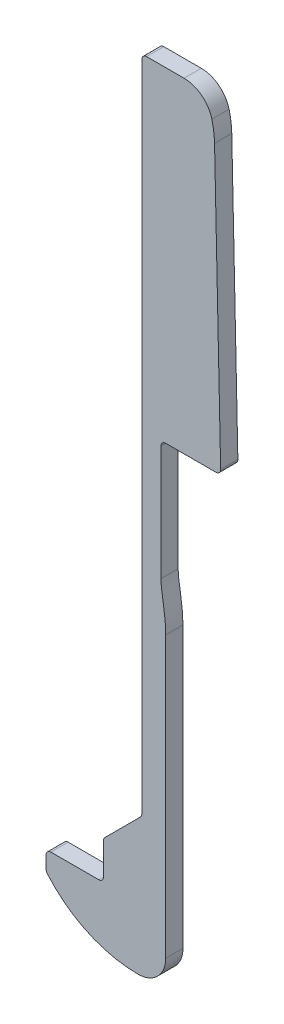
ISO-10303-21;
HEADER;
FILE_DESCRIPTION(('STEP AP214'),'2;1');
FILE_NAME('part.step','',(''),(''),'','','');
FILE_SCHEMA(('AUTOMOTIVE_DESIGN { 1 0 10303 214 1 1 1 1 }'));
ENDSEC;
DATA;
#1=APPLICATION_CONTEXT('core data for automotive mechanical design processes');
#2=APPLICATION_PROTOCOL_DEFINITION('international standard','automotive_design',2000,#1);
#3=PRODUCT_CONTEXT('',#1,'mechanical');
#4=PRODUCT('Part','Part','',(#3));
#5=PRODUCT_RELATED_PRODUCT_CATEGORY('part','',(#4));
#6=PRODUCT_DEFINITION_FORMATION('','',#4);
#7=PRODUCT_DEFINITION_CONTEXT('part definition',#1,'design');
#8=PRODUCT_DEFINITION('design','',#6,#7);
#9=PRODUCT_DEFINITION_SHAPE('','',#8);
#10=(LENGTH_UNIT() NAMED_UNIT(*) SI_UNIT(.MILLI.,.METRE.));
#11=(NAMED_UNIT(*) PLANE_ANGLE_UNIT() SI_UNIT($,.RADIAN.));
#12=(NAMED_UNIT(*) SI_UNIT($,.STERADIAN.) SOLID_ANGLE_UNIT());
#13=UNCERTAINTY_MEASURE_WITH_UNIT(LENGTH_MEASURE(1.E-05),#10,'distance_accuracy_value','');
#14=(GEOMETRIC_REPRESENTATION_CONTEXT(3) GLOBAL_UNCERTAINTY_ASSIGNED_CONTEXT((#13)) GLOBAL_UNIT_ASSIGNED_CONTEXT((#10,
#11,#12)) REPRESENTATION_CONTEXT('',''));
#15=CARTESIAN_POINT('',(0.,0.,0.));
#16=DIRECTION('',(0.,0.,1.));
#17=DIRECTION('',(1.,0.,0.));
#18=AXIS2_PLACEMENT_3D('',#15,#16,#17);
#19=CARTESIAN_POINT('',(14.4143233217841,80.5,1.8));
#20=DIRECTION('',(0.,0.,-1.));
#21=DIRECTION('',(-1.,0.,0.));
#22=AXIS2_PLACEMENT_3D('',#19,#20,#21);
#23=CYLINDRICAL_SURFACE('',#22,3.);
#24=DIRECTION('',(0.,0.,-1.));
#25=VECTOR('',#24,1.);
#26=CARTESIAN_POINT('',(17.3194338133368,81.2485539605604,1.8));
#27=LINE('',#26,#25);
#28=CARTESIAN_POINT('',(17.3194338133368,81.2485539605604,0.));
#29=VERTEX_POINT('',#28);
#30=CARTESIAN_POINT('',(17.3194338133368,81.2485539605604,1.8));
#31=VERTEX_POINT('',#30);
#32=EDGE_CURVE('E291',#29,#31,#27,.F.);
#33=ORIENTED_EDGE('',*,*,#32,.F.);
#34=CARTESIAN_POINT('',(14.4143233217841,80.5,0.));
#35=DIRECTION('',(0.,0.,-1.));
#36=DIRECTION('',(-1.,0.,0.));
#37=AXIS2_PLACEMENT_3D('',#34,#35,#36);
#38=CIRCLE('',#37,3.);
#39=CARTESIAN_POINT('',(14.4143233217841,83.5,0.));
#40=VERTEX_POINT('',#39);
#41=EDGE_CURVE('E45',#40,#29,#38,.T.);
#42=ORIENTED_EDGE('',*,*,#41,.F.);
#43=DIRECTION('',(0.,0.,-1.));
#44=VECTOR('',#43,1.);
#45=CARTESIAN_POINT('',(14.4143233217841,83.5,1.8));
#46=LINE('',#45,#44);
#47=CARTESIAN_POINT('',(14.4143233217841,83.5,1.8));
#48=VERTEX_POINT('',#47);
#49=EDGE_CURVE('E294',#48,#40,#46,.T.);
#50=ORIENTED_EDGE('',*,*,#49,.F.);
#51=CARTESIAN_POINT('',(14.4143233217841,80.5,1.8));
#52=DIRECTION('',(0.,0.,-1.));
#53=DIRECTION('',(-1.,0.,0.));
#54=AXIS2_PLACEMENT_3D('',#51,#52,#53);
#55=CIRCLE('',#54,3.);
#56=EDGE_CURVE('E11',#31,#48,#55,.F.);
#57=ORIENTED_EDGE('',*,*,#56,.F.);
#58=EDGE_LOOP('',(#33,#42,#50,#57));
#59=FACE_BOUND('',#58,.T.);
#60=ADVANCED_FACE('F38',(#59),#23,.T.);
#61=CARTESIAN_POINT('',(9.61,12.5113444444444,1.8));
#62=DIRECTION('',(0.,0.,-1.));
#63=DIRECTION('',(-1.,0.,0.));
#64=AXIS2_PLACEMENT_3D('',#61,#62,#63);
#65=CYLINDRICAL_SURFACE('',#64,12.5113444444444);
#66=CARTESIAN_POINT('',(9.61,12.5113444444444,1.8));
#67=DIRECTION('',(0.,0.,1.));
#68=DIRECTION('',(-1.,0.,0.));
#69=AXIS2_PLACEMENT_3D('',#66,#67,#68);
#70=CIRCLE('',#69,12.5113444444444);
#71=CARTESIAN_POINT('',(0.120775174580328,4.35730544403674,1.8));
#72=VERTEX_POINT('',#71);
#73=CARTESIAN_POINT('',(9.61,0.,1.8));
#74=VERTEX_POINT('',#73);
#75=EDGE_CURVE('E187',#72,#74,#70,.T.);
#76=ORIENTED_EDGE('',*,*,#75,.F.);
#77=DIRECTION('',(0.,0.,-1.));
#78=VECTOR('',#77,1.);
#79=CARTESIAN_POINT('',(0.120775174580328,4.35730544403674,1.8));
#80=LINE('',#79,#78);
#81=CARTESIAN_POINT('',(0.120775174580328,4.35730544403674,0.));
#82=VERTEX_POINT('',#81);
#83=EDGE_CURVE('E247',#72,#82,#80,.T.);
#84=ORIENTED_EDGE('',*,*,#83,.T.);
#85=CARTESIAN_POINT('',(9.61,12.5113444444444,0.));
#86=DIRECTION('',(0.,0.,1.));
#87=DIRECTION('',(-1.,0.,0.));
#88=AXIS2_PLACEMENT_3D('',#85,#86,#87);
#89=CIRCLE('',#88,12.5113444444444);
#90=CARTESIAN_POINT('',(9.61,0.,0.));
#91=VERTEX_POINT('',#90);
#92=EDGE_CURVE('E212',#82,#91,#89,.T.);
#93=ORIENTED_EDGE('',*,*,#92,.T.);
#94=DIRECTION('',(0.,0.,-1.));
#95=VECTOR('',#94,1.);
#96=CARTESIAN_POINT('',(9.61,0.,1.8));
#97=LINE('',#96,#95);
#98=EDGE_CURVE('E204',#74,#91,#97,.T.);
#99=ORIENTED_EDGE('',*,*,#98,.F.);
#100=EDGE_LOOP('',(#76,#84,#93,#99));
#101=FACE_BOUND('',#100,.T.);
#102=ADVANCED_FACE('F210',(#101),#65,.T.);
#103=CARTESIAN_POINT('',(9.61,2.89,1.8));
#104=DIRECTION('',(0.,0.,-1.));
#105=DIRECTION('',(-1.,0.,0.));
#106=AXIS2_PLACEMENT_3D('',#103,#104,#105);
#107=CYLINDRICAL_SURFACE('',#106,2.89000000000001);
#108=CARTESIAN_POINT('',(9.61,2.89,0.));
#109=DIRECTION('',(0.,0.,1.));
#110=DIRECTION('',(-1.,0.,0.));
#111=AXIS2_PLACEMENT_3D('',#108,#109,#110);
#112=CIRCLE('',#111,2.89000000000001);
#113=CARTESIAN_POINT('',(12.5,2.89,0.));
#114=VERTEX_POINT('',#113);
#115=EDGE_CURVE('E351',#91,#114,#112,.T.);
#116=ORIENTED_EDGE('',*,*,#115,.T.);
#117=DIRECTION('',(0.,0.,-1.));
#118=VECTOR('',#117,1.);
#119=CARTESIAN_POINT('',(12.5,2.89,1.8));
#120=LINE('',#119,#118);
#121=CARTESIAN_POINT('',(12.5,2.89,1.8));
#122=VERTEX_POINT('',#121);
#123=EDGE_CURVE('E206',#122,#114,#120,.T.);
#124=ORIENTED_EDGE('',*,*,#123,.F.);
#125=CARTESIAN_POINT('',(9.61,2.89,1.8));
#126=DIRECTION('',(0.,0.,1.));
#127=DIRECTION('',(-1.,0.,0.));
#128=AXIS2_PLACEMENT_3D('',#125,#126,#127);
#129=CIRCLE('',#128,2.89000000000001);
#130=EDGE_CURVE('E190',#74,#122,#129,.T.);
#131=ORIENTED_EDGE('',*,*,#130,.F.);
#132=ORIENTED_EDGE('',*,*,#98,.T.);
#133=EDGE_LOOP('',(#116,#124,#131,#132));
#134=FACE_BOUND('',#133,.T.);
#135=ADVANCED_FACE('F203',(#134),#107,.T.);
#136=CARTESIAN_POINT('',(12.5,32.15,1.8));
#137=DIRECTION('',(-1.,0.,0.));
#138=DIRECTION('',(0.,-1.,0.));
#139=AXIS2_PLACEMENT_3D('',#136,#137,#138);
#140=PLANE('',#139);
#141=DIRECTION('',(0.,1.,0.));
#142=VECTOR('',#141,1.);
#143=CARTESIAN_POINT('',(12.5,32.15,0.));
#144=LINE('',#143,#142);
#145=CARTESIAN_POINT('',(12.5,32.15,0.));
#146=VERTEX_POINT('',#145);
#147=EDGE_CURVE('E346',#114,#146,#144,.T.);
#148=ORIENTED_EDGE('',*,*,#147,.T.);
#149=DIRECTION('',(0.,0.,-1.));
#150=VECTOR('',#149,1.);
#151=CARTESIAN_POINT('',(12.5,32.15,1.8));
#152=LINE('',#151,#150);
#153=CARTESIAN_POINT('',(12.5,32.15,1.8));
#154=VERTEX_POINT('',#153);
#155=EDGE_CURVE('E218',#154,#146,#152,.T.);
#156=ORIENTED_EDGE('',*,*,#155,.F.);
#157=DIRECTION('',(0.,1.,0.));
#158=VECTOR('',#157,1.);
#159=CARTESIAN_POINT('',(12.5,32.15,1.8));
#160=LINE('',#159,#158);
#161=EDGE_CURVE('E208',#122,#154,#160,.T.);
#162=ORIENTED_EDGE('',*,*,#161,.F.);
#163=ORIENTED_EDGE('',*,*,#123,.T.);
#164=EDGE_LOOP('',(#148,#156,#162,#163));
#165=FACE_BOUND('',#164,.T.);
#166=ADVANCED_FACE('F398',(#165),#140,.F.);
#167=CARTESIAN_POINT('',(12.5,32.15,1.8));
#168=CARTESIAN_POINT('',(12.5,34.1534508074309,1.8));
#169=CARTESIAN_POINT('',(12.,35.7421929324208,1.8));
#170=CARTESIAN_POINT('',(12.,37.,1.8));
#171=B_SPLINE_CURVE_WITH_KNOTS('',3,(#167,#168,#169,#170),.UNSPECIFIED.,.F.,.F.,(4,4),(0.,1.),.UNSPECIFIED.);
#172=DIRECTION('',(0.,0.,-1.));
#173=VECTOR('',#172,1.);
#174=SURFACE_OF_LINEAR_EXTRUSION('',#171,#173);
#175=CARTESIAN_POINT('',(12.5,32.15,0.));
#176=CARTESIAN_POINT('',(12.5,34.1534508074309,0.));
#177=CARTESIAN_POINT('',(12.,35.7421929324208,0.));
#178=CARTESIAN_POINT('',(12.,37.,0.));
#179=B_SPLINE_CURVE_WITH_KNOTS('',3,(#175,#176,#177,#178),.UNSPECIFIED.,.F.,.F.,(4,4),(0.,1.),.UNSPECIFIED.);
#180=CARTESIAN_POINT('',(12.,37.,0.));
#181=VERTEX_POINT('',#180);
#182=EDGE_CURVE('E341',#146,#181,#179,.T.);
#183=ORIENTED_EDGE('',*,*,#182,.T.);
#184=DIRECTION('',(0.,0.,-1.));
#185=VECTOR('',#184,1.);
#186=CARTESIAN_POINT('',(12.,37.,1.8));
#187=LINE('',#186,#185);
#188=CARTESIAN_POINT('',(12.,37.,1.8));
#189=VERTEX_POINT('',#188);
#190=EDGE_CURVE('E331',#189,#181,#187,.T.);
#191=ORIENTED_EDGE('',*,*,#190,.F.);
#192=EDGE_CURVE('E342',#154,#189,#171,.T.);
#193=ORIENTED_EDGE('',*,*,#192,.F.);
#194=ORIENTED_EDGE('',*,*,#155,.T.);
#195=EDGE_LOOP('',(#183,#191,#193,#194));
#196=FACE_BOUND('',#195,.T.);
#197=ADVANCED_FACE('F339',(#196),#174,.F.);
#198=CARTESIAN_POINT('',(12.,49.5,1.8));
#199=DIRECTION('',(-1.,0.,0.));
#200=DIRECTION('',(0.,-1.,0.));
#201=AXIS2_PLACEMENT_3D('',#198,#199,#200);
#202=PLANE('',#201);
#203=DIRECTION('',(0.,1.,0.));
#204=VECTOR('',#203,1.);
#205=CARTESIAN_POINT('',(12.,49.5,0.));
#206=LINE('',#205,#204);
#207=CARTESIAN_POINT('',(12.,49.,0.));
#208=VERTEX_POINT('',#207);
#209=EDGE_CURVE('E348',#181,#208,#206,.T.);
#210=ORIENTED_EDGE('',*,*,#209,.T.);
#211=DIRECTION('',(0.,0.,-1.));
#212=VECTOR('',#211,1.);
#213=CARTESIAN_POINT('',(12.,49.,1.8));
#214=LINE('',#213,#212);
#215=CARTESIAN_POINT('',(12.,49.,1.8));
#216=VERTEX_POINT('',#215);
#217=EDGE_CURVE('E274',#208,#216,#214,.F.);
#218=ORIENTED_EDGE('',*,*,#217,.T.);
#219=DIRECTION('',(0.,1.,0.));
#220=VECTOR('',#219,1.);
#221=CARTESIAN_POINT('',(12.,49.5,1.8));
#222=LINE('',#221,#220);
#223=EDGE_CURVE('E380',#189,#216,#222,.T.);
#224=ORIENTED_EDGE('',*,*,#223,.F.);
#225=ORIENTED_EDGE('',*,*,#190,.T.);
#226=EDGE_LOOP('',(#210,#218,#224,#225));
#227=FACE_BOUND('',#226,.T.);
#228=ADVANCED_FACE('F411',(#227),#202,.F.);
#229=CARTESIAN_POINT('',(18.25,49.5,1.8));
#230=DIRECTION('',(0.,1.,0.));
#231=DIRECTION('',(0.,0.,1.));
#232=AXIS2_PLACEMENT_3D('',#229,#230,#231);
#233=PLANE('',#232);
#234=DIRECTION('',(1.,0.,0.));
#235=VECTOR('',#234,1.);
#236=CARTESIAN_POINT('',(18.25,49.5,1.8));
#237=LINE('',#236,#235);
#238=CARTESIAN_POINT('',(12.5,49.5,1.8));
#239=VERTEX_POINT('',#238);
#240=CARTESIAN_POINT('',(17.7389709464066,49.5,1.8));
#241=VERTEX_POINT('',#240);
#242=EDGE_CURVE('E373',#239,#241,#237,.T.);
#243=ORIENTED_EDGE('',*,*,#242,.F.);
#244=DIRECTION('',(0.,0.,-1.));
#245=VECTOR('',#244,1.);
#246=CARTESIAN_POINT('',(12.5,49.5,0.));
#247=LINE('',#246,#245);
#248=CARTESIAN_POINT('',(12.5,49.5,0.));
#249=VERTEX_POINT('',#248);
#250=EDGE_CURVE('E271',#239,#249,#247,.T.);
#251=ORIENTED_EDGE('',*,*,#250,.T.);
#252=DIRECTION('',(1.,0.,0.));
#253=VECTOR('',#252,1.);
#254=CARTESIAN_POINT('',(18.25,49.5,0.));
#255=LINE('',#254,#253);
#256=CARTESIAN_POINT('',(17.7389709464066,49.5,0.));
#257=VERTEX_POINT('',#256);
#258=EDGE_CURVE('E313',#249,#257,#255,.T.);
#259=ORIENTED_EDGE('',*,*,#258,.T.);
#260=DIRECTION('',(0.,0.,-1.));
#261=VECTOR('',#260,1.);
#262=CARTESIAN_POINT('',(17.7389709464066,49.5,1.8));
#263=LINE('',#262,#261);
#264=EDGE_CURVE('E269',#257,#241,#263,.F.);
#265=ORIENTED_EDGE('',*,*,#264,.T.);
#266=EDGE_LOOP('',(#243,#251,#259,#265));
#267=FACE_BOUND('',#266,.T.);
#268=ADVANCED_FACE('F364',(#267),#233,.F.);
#269=CARTESIAN_POINT('',(18.25,49.5,1.8));
#270=DIRECTION('',(-0.999762027079909,-0.0218148850345616,0.));
#271=DIRECTION('',(0.0218148850345616,-0.999762027079909,0.));
#272=AXIS2_PLACEMENT_3D('',#269,#270,#271);
#273=PLANE('',#272);
#274=DIRECTION('',(-0.0218148850345616,0.999762027079909,0.));
#275=VECTOR('',#274,1.);
#276=CARTESIAN_POINT('',(18.25,49.5,1.8));
#277=LINE('',#276,#275);
#278=CARTESIAN_POINT('',(18.2388519599465,50.0109074425173,1.8));
#279=VERTEX_POINT('',#278);
#280=CARTESIAN_POINT('',(17.601960582398,79.1992260441903,1.8));
#281=VERTEX_POINT('',#280);
#282=EDGE_CURVE('E372',#279,#281,#277,.T.);
#283=ORIENTED_EDGE('',*,*,#282,.F.);
#284=DIRECTION('',(0.,0.,-1.));
#285=VECTOR('',#284,1.);
#286=CARTESIAN_POINT('',(18.2388519599465,50.0109074425173,1.8));
#287=LINE('',#286,#285);
#288=CARTESIAN_POINT('',(18.2388519599465,50.0109074425173,0.));
#289=VERTEX_POINT('',#288);
#290=EDGE_CURVE('E276',#279,#289,#287,.T.);
#291=ORIENTED_EDGE('',*,*,#290,.T.);
#292=DIRECTION('',(-0.0218148850345616,0.999762027079909,0.));
#293=VECTOR('',#292,1.);
#294=CARTESIAN_POINT('',(18.25,49.5,0.));
#295=LINE('',#294,#293);
#296=CARTESIAN_POINT('',(17.601960582398,79.1992260441903,0.));
#297=VERTEX_POINT('',#296);
#298=EDGE_CURVE('E309',#289,#297,#295,.T.);
#299=ORIENTED_EDGE('',*,*,#298,.T.);
#300=DIRECTION('',(0.,0.,-1.));
#301=VECTOR('',#300,1.);
#302=CARTESIAN_POINT('',(17.601960582398,79.1992260441903,1.8));
#303=LINE('',#302,#301);
#304=EDGE_CURVE('E308',#281,#297,#303,.T.);
#305=ORIENTED_EDGE('',*,*,#304,.F.);
#306=EDGE_LOOP('',(#283,#291,#299,#305));
#307=FACE_BOUND('',#306,.T.);
#308=ADVANCED_FACE('F375',(#307),#273,.F.);
#309=CARTESIAN_POINT('',(8.60410233867879,79.0028920788793,1.8));
#310=DIRECTION('',(0.,0.,-1.));
#311=DIRECTION('',(-1.,0.,0.));
#312=AXIS2_PLACEMENT_3D('',#309,#310,#311);
#313=CYLINDRICAL_SURFACE('',#312,9.00000000000001);
#314=CARTESIAN_POINT('',(8.60410233867879,79.0028920788793,0.));
#315=DIRECTION('',(0.,0.,1.));
#316=DIRECTION('',(1.,0.,0.));
#317=AXIS2_PLACEMENT_3D('',#314,#315,#316);
#318=CIRCLE('',#317,9.00000000000001);
#319=EDGE_CURVE('E301',#297,#29,#318,.T.);
#320=ORIENTED_EDGE('',*,*,#319,.T.);
#321=ORIENTED_EDGE('',*,*,#32,.T.);
#322=CARTESIAN_POINT('',(8.60410233867879,79.0028920788793,1.8));
#323=DIRECTION('',(0.,0.,1.));
#324=DIRECTION('',(1.,0.,0.));
#325=AXIS2_PLACEMENT_3D('',#322,#323,#324);
#326=CIRCLE('',#325,9.00000000000001);
#327=EDGE_CURVE('E376',#281,#31,#326,.T.);
#328=ORIENTED_EDGE('',*,*,#327,.F.);
#329=ORIENTED_EDGE('',*,*,#304,.T.);
#330=EDGE_LOOP('',(#320,#321,#328,#329));
#331=FACE_BOUND('',#330,.T.);
#332=ADVANCED_FACE('F306',(#331),#313,.T.);
#333=CARTESIAN_POINT('',(10.,83.5,1.8));
#334=DIRECTION('',(0.,-1.,0.));
#335=DIRECTION('',(0.,0.,-1.));
#336=AXIS2_PLACEMENT_3D('',#333,#334,#335);
#337=PLANE('',#336);
#338=DIRECTION('',(-1.,0.,0.));
#339=VECTOR('',#338,1.);
#340=CARTESIAN_POINT('',(10.,83.5,1.8));
#341=LINE('',#340,#339);
#342=CARTESIAN_POINT('',(10.5,83.5,1.8));
#343=VERTEX_POINT('',#342);
#344=EDGE_CURVE('E378',#48,#343,#341,.T.);
#345=ORIENTED_EDGE('',*,*,#344,.F.);
#346=ORIENTED_EDGE('',*,*,#49,.T.);
#347=DIRECTION('',(-1.,0.,0.));
#348=VECTOR('',#347,1.);
#349=CARTESIAN_POINT('',(10.,83.5,0.));
#350=LINE('',#349,#348);
#351=CARTESIAN_POINT('',(10.5,83.5,0.));
#352=VERTEX_POINT('',#351);
#353=EDGE_CURVE('E302',#40,#352,#350,.T.);
#354=ORIENTED_EDGE('',*,*,#353,.T.);
#355=DIRECTION('',(0.,0.,-1.));
#356=VECTOR('',#355,1.);
#357=CARTESIAN_POINT('',(10.5,83.5,1.8));
#358=LINE('',#357,#356);
#359=EDGE_CURVE('E235',#352,#343,#358,.F.);
#360=ORIENTED_EDGE('',*,*,#359,.T.);
#361=EDGE_LOOP('',(#345,#346,#354,#360));
#362=FACE_BOUND('',#361,.T.);
#363=ADVANCED_FACE('F493',(#362),#337,.F.);
#364=CARTESIAN_POINT('',(10.,14.5,1.8));
#365=DIRECTION('',(1.,0.,0.));
#366=DIRECTION('',(0.,0.,-1.));
#367=AXIS2_PLACEMENT_3D('',#364,#365,#366);
#368=PLANE('',#367);
#369=DIRECTION('',(0.,-1.,0.));
#370=VECTOR('',#369,1.);
#371=CARTESIAN_POINT('',(10.,14.5,1.8));
#372=LINE('',#371,#370);
#373=CARTESIAN_POINT('',(10.,83.,1.8));
#374=VERTEX_POINT('',#373);
#375=CARTESIAN_POINT('',(10.,14.7071067811865,1.8));
#376=VERTEX_POINT('',#375);
#377=EDGE_CURVE('E385',#374,#376,#372,.T.);
#378=ORIENTED_EDGE('',*,*,#377,.F.);
#379=DIRECTION('',(0.,0.,-1.));
#380=VECTOR('',#379,1.);
#381=CARTESIAN_POINT('',(10.,83.,1.8));
#382=LINE('',#381,#380);
#383=CARTESIAN_POINT('',(10.,83.,0.));
#384=VERTEX_POINT('',#383);
#385=EDGE_CURVE('E216',#374,#384,#382,.T.);
#386=ORIENTED_EDGE('',*,*,#385,.T.);
#387=DIRECTION('',(0.,-1.,0.));
#388=VECTOR('',#387,1.);
#389=CARTESIAN_POINT('',(10.,14.5,0.));
#390=LINE('',#389,#388);
#391=CARTESIAN_POINT('',(10.,14.7071067811865,0.));
#392=VERTEX_POINT('',#391);
#393=EDGE_CURVE('E311',#384,#392,#390,.T.);
#394=ORIENTED_EDGE('',*,*,#393,.T.);
#395=DIRECTION('',(0.,0.,-1.));
#396=VECTOR('',#395,1.);
#397=CARTESIAN_POINT('',(10.,14.7071067811865,1.8));
#398=LINE('',#397,#396);
#399=EDGE_CURVE('E214',#392,#376,#398,.F.);
#400=ORIENTED_EDGE('',*,*,#399,.T.);
#401=EDGE_LOOP('',(#378,#386,#394,#400));
#402=FACE_BOUND('',#401,.T.);
#403=ADVANCED_FACE('F500',(#402),#368,.F.);
#404=CARTESIAN_POINT('',(6.,10.5,1.8));
#405=DIRECTION('',(0.707106781186546,-0.707106781186549,0.));
#406=DIRECTION('',(0.707106781186549,0.707106781186546,0.));
#407=AXIS2_PLACEMENT_3D('',#404,#405,#406);
#408=PLANE('',#407);
#409=DIRECTION('',(-0.707106781186549,-0.707106781186546,0.));
#410=VECTOR('',#409,1.);
#411=CARTESIAN_POINT('',(6.,10.5,1.8));
#412=LINE('',#411,#410);
#413=CARTESIAN_POINT('',(9.85355339059327,14.3535533905933,1.8));
#414=VERTEX_POINT('',#413);
#415=CARTESIAN_POINT('',(6.14644660940673,10.6464466094067,1.8));
#416=VERTEX_POINT('',#415);
#417=EDGE_CURVE('E388',#414,#416,#412,.T.);
#418=ORIENTED_EDGE('',*,*,#417,.F.);
#419=DIRECTION('',(0.,0.,-1.));
#420=VECTOR('',#419,1.);
#421=CARTESIAN_POINT('',(9.85355339059327,14.3535533905933,0.));
#422=LINE('',#421,#420);
#423=CARTESIAN_POINT('',(9.85355339059327,14.3535533905933,0.));
#424=VERTEX_POINT('',#423);
#425=EDGE_CURVE('E266',#414,#424,#422,.T.);
#426=ORIENTED_EDGE('',*,*,#425,.T.);
#427=DIRECTION('',(-0.707106781186549,-0.707106781186546,0.));
#428=VECTOR('',#427,1.);
#429=CARTESIAN_POINT('',(6.,10.5,0.));
#430=LINE('',#429,#428);
#431=CARTESIAN_POINT('',(6.14644660940673,10.6464466094067,0.));
#432=VERTEX_POINT('',#431);
#433=EDGE_CURVE('E319',#424,#432,#430,.T.);
#434=ORIENTED_EDGE('',*,*,#433,.T.);
#435=DIRECTION('',(0.,0.,-1.));
#436=VECTOR('',#435,1.);
#437=CARTESIAN_POINT('',(6.14644660940673,10.6464466094067,1.8));
#438=LINE('',#437,#436);
#439=EDGE_CURVE('E264',#432,#416,#438,.F.);
#440=ORIENTED_EDGE('',*,*,#439,.T.);
#441=EDGE_LOOP('',(#418,#426,#434,#440));
#442=FACE_BOUND('',#441,.T.);
#443=ADVANCED_FACE('F508',(#442),#408,.F.);
#444=CARTESIAN_POINT('',(6.,6.5,1.8));
#445=DIRECTION('',(1.,0.,0.));
#446=DIRECTION('',(0.,0.,-1.));
#447=AXIS2_PLACEMENT_3D('',#444,#445,#446);
#448=PLANE('',#447);
#449=DIRECTION('',(0.,-1.,0.));
#450=VECTOR('',#449,1.);
#451=CARTESIAN_POINT('',(6.,6.5,0.));
#452=LINE('',#451,#450);
#453=CARTESIAN_POINT('',(6.,10.2928932188135,0.));
#454=VERTEX_POINT('',#453);
#455=CARTESIAN_POINT('',(6.,7.,0.));
#456=VERTEX_POINT('',#455);
#457=EDGE_CURVE('E322',#454,#456,#452,.T.);
#458=ORIENTED_EDGE('',*,*,#457,.T.);
#459=DIRECTION('',(0.,0.,-1.));
#460=VECTOR('',#459,1.);
#461=CARTESIAN_POINT('',(6.,7.,1.8));
#462=LINE('',#461,#460);
#463=CARTESIAN_POINT('',(6.,7.,1.8));
#464=VERTEX_POINT('',#463);
#465=EDGE_CURVE('E262',#456,#464,#462,.F.);
#466=ORIENTED_EDGE('',*,*,#465,.T.);
#467=DIRECTION('',(0.,-1.,0.));
#468=VECTOR('',#467,1.);
#469=CARTESIAN_POINT('',(6.,6.5,1.8));
#470=LINE('',#469,#468);
#471=CARTESIAN_POINT('',(6.,10.2928932188135,1.8));
#472=VERTEX_POINT('',#471);
#473=EDGE_CURVE('E391',#472,#464,#470,.T.);
#474=ORIENTED_EDGE('',*,*,#473,.F.);
#475=DIRECTION('',(0.,0.,-1.));
#476=VECTOR('',#475,1.);
#477=CARTESIAN_POINT('',(6.,10.2928932188135,1.8));
#478=LINE('',#477,#476);
#479=EDGE_CURVE('E259',#472,#454,#478,.T.);
#480=ORIENTED_EDGE('',*,*,#479,.T.);
#481=EDGE_LOOP('',(#458,#466,#474,#480));
#482=FACE_BOUND('',#481,.T.);
#483=ADVANCED_FACE('F516',(#482),#448,.F.);
#484=CARTESIAN_POINT('',(0.,6.5,1.8));
#485=DIRECTION('',(0.,-1.,0.));
#486=DIRECTION('',(0.,0.,-1.));
#487=AXIS2_PLACEMENT_3D('',#484,#485,#486);
#488=PLANE('',#487);
#489=DIRECTION('',(-1.,0.,0.));
#490=VECTOR('',#489,1.);
#491=CARTESIAN_POINT('',(0.,6.5,0.));
#492=LINE('',#491,#490);
#493=CARTESIAN_POINT('',(5.5,6.5,0.));
#494=VERTEX_POINT('',#493);
#495=CARTESIAN_POINT('',(0.5,6.5,0.));
#496=VERTEX_POINT('',#495);
#497=EDGE_CURVE('E325',#494,#496,#492,.T.);
#498=ORIENTED_EDGE('',*,*,#497,.T.);
#499=DIRECTION('',(0.,0.,-1.));
#500=VECTOR('',#499,1.);
#501=CARTESIAN_POINT('',(0.5,6.5,1.8));
#502=LINE('',#501,#500);
#503=CARTESIAN_POINT('',(0.5,6.5,1.8));
#504=VERTEX_POINT('',#503);
#505=EDGE_CURVE('E257',#496,#504,#502,.F.);
#506=ORIENTED_EDGE('',*,*,#505,.T.);
#507=DIRECTION('',(-1.,0.,0.));
#508=VECTOR('',#507,1.);
#509=CARTESIAN_POINT('',(0.,6.5,1.8));
#510=LINE('',#509,#508);
#511=CARTESIAN_POINT('',(5.5,6.5,1.8));
#512=VERTEX_POINT('',#511);
#513=EDGE_CURVE('E394',#512,#504,#510,.T.);
#514=ORIENTED_EDGE('',*,*,#513,.F.);
#515=DIRECTION('',(0.,0.,-1.));
#516=VECTOR('',#515,1.);
#517=CARTESIAN_POINT('',(5.5,6.5,0.));
#518=LINE('',#517,#516);
#519=EDGE_CURVE('E254',#512,#494,#518,.T.);
#520=ORIENTED_EDGE('',*,*,#519,.T.);
#521=EDGE_LOOP('',(#498,#506,#514,#520));
#522=FACE_BOUND('',#521,.T.);
#523=ADVANCED_FACE('F524',(#522),#488,.F.);
#524=CARTESIAN_POINT('',(0.,4.5,1.8));
#525=DIRECTION('',(1.,0.,0.));
#526=DIRECTION('',(0.,0.,-1.));
#527=AXIS2_PLACEMENT_3D('',#524,#525,#526);
#528=PLANE('',#527);
#529=DIRECTION('',(0.,-1.,0.));
#530=VECTOR('',#529,1.);
#531=CARTESIAN_POINT('',(0.,4.5,0.));
#532=LINE('',#531,#530);
#533=CARTESIAN_POINT('',(0.,6.,0.));
#534=VERTEX_POINT('',#533);
#535=CARTESIAN_POINT('',(0.,4.68317126271894,0.));
#536=VERTEX_POINT('',#535);
#537=EDGE_CURVE('E199',#534,#536,#532,.T.);
#538=ORIENTED_EDGE('',*,*,#537,.T.);
#539=DIRECTION('',(0.,0.,-1.));
#540=VECTOR('',#539,1.);
#541=CARTESIAN_POINT('',(0.,4.68317126271894,1.8));
#542=LINE('',#541,#540);
#543=CARTESIAN_POINT('',(0.,4.68317126271894,1.8));
#544=VERTEX_POINT('',#543);
#545=EDGE_CURVE('E252',#536,#544,#542,.F.);
#546=ORIENTED_EDGE('',*,*,#545,.T.);
#547=DIRECTION('',(0.,-1.,0.));
#548=VECTOR('',#547,1.);
#549=CARTESIAN_POINT('',(0.,4.5,1.8));
#550=LINE('',#549,#548);
#551=CARTESIAN_POINT('',(0.,6.,1.8));
#552=VERTEX_POINT('',#551);
#553=EDGE_CURVE('E332',#552,#544,#550,.T.);
#554=ORIENTED_EDGE('',*,*,#553,.F.);
#555=DIRECTION('',(0.,0.,-1.));
#556=VECTOR('',#555,1.);
#557=CARTESIAN_POINT('',(0.,6.,1.8));
#558=LINE('',#557,#556);
#559=EDGE_CURVE('E249',#552,#534,#558,.T.);
#560=ORIENTED_EDGE('',*,*,#559,.T.);
#561=EDGE_LOOP('',(#538,#546,#554,#560));
#562=FACE_BOUND('',#561,.T.);
#563=ADVANCED_FACE('F532',(#562),#528,.F.);
#564=CARTESIAN_POINT('',(9.61,12.5113444444444,1.8));
#565=DIRECTION('',(0.,0.,-1.));
#566=DIRECTION('',(-1.,0.,0.));
#567=AXIS2_PLACEMENT_3D('',#564,#565,#566);
#568=PLANE('',#567);
#569=ORIENTED_EDGE('',*,*,#327,.T.);
#570=ORIENTED_EDGE('',*,*,#56,.T.);
#571=ORIENTED_EDGE('',*,*,#344,.T.);
#572=CARTESIAN_POINT('',(10.5,83.,1.8));
#573=DIRECTION('',(0.,0.,-1.));
#574=DIRECTION('',(-1.,0.,0.));
#575=AXIS2_PLACEMENT_3D('',#572,#573,#574);
#576=CIRCLE('',#575,0.5);
#577=EDGE_CURVE('E245',#343,#374,#576,.F.);
#578=ORIENTED_EDGE('',*,*,#577,.T.);
#579=ORIENTED_EDGE('',*,*,#377,.T.);
#580=CARTESIAN_POINT('',(9.5,14.7071067811865,1.8));
#581=DIRECTION('',(0.,0.,-1.));
#582=DIRECTION('',(-1.,0.,0.));
#583=AXIS2_PLACEMENT_3D('',#580,#581,#582);
#584=CIRCLE('',#583,0.5);
#585=EDGE_CURVE('E285',#376,#414,#584,.T.);
#586=ORIENTED_EDGE('',*,*,#585,.T.);
#587=ORIENTED_EDGE('',*,*,#417,.T.);
#588=CARTESIAN_POINT('',(6.5,10.2928932188135,1.8));
#589=DIRECTION('',(0.,0.,-1.));
#590=DIRECTION('',(-1.,0.,0.));
#591=AXIS2_PLACEMENT_3D('',#588,#589,#590);
#592=CIRCLE('',#591,0.5);
#593=EDGE_CURVE('E240',#416,#472,#592,.F.);
#594=ORIENTED_EDGE('',*,*,#593,.T.);
#595=ORIENTED_EDGE('',*,*,#473,.T.);
#596=CARTESIAN_POINT('',(5.5,7.,1.8));
#597=DIRECTION('',(0.,0.,-1.));
#598=DIRECTION('',(-1.,0.,0.));
#599=AXIS2_PLACEMENT_3D('',#596,#597,#598);
#600=CIRCLE('',#599,0.5);
#601=EDGE_CURVE('E281',#464,#512,#600,.T.);
#602=ORIENTED_EDGE('',*,*,#601,.T.);
#603=ORIENTED_EDGE('',*,*,#513,.T.);
#604=CARTESIAN_POINT('',(0.5,6.,1.8));
#605=DIRECTION('',(0.,0.,-1.));
#606=DIRECTION('',(-1.,0.,0.));
#607=AXIS2_PLACEMENT_3D('',#604,#605,#606);
#608=CIRCLE('',#607,0.5);
#609=EDGE_CURVE('E242',#504,#552,#608,.F.);
#610=ORIENTED_EDGE('',*,*,#609,.T.);
#611=ORIENTED_EDGE('',*,*,#553,.T.);
#612=CARTESIAN_POINT('',(0.5,4.68317126271894,1.8));
#613=DIRECTION('',(0.,0.,-1.));
#614=DIRECTION('',(-1.,0.,0.));
#615=AXIS2_PLACEMENT_3D('',#612,#613,#614);
#616=CIRCLE('',#615,0.5);
#617=EDGE_CURVE('E194',#544,#72,#616,.F.);
#618=ORIENTED_EDGE('',*,*,#617,.T.);
#619=ORIENTED_EDGE('',*,*,#75,.T.);
#620=ORIENTED_EDGE('',*,*,#130,.T.);
#621=ORIENTED_EDGE('',*,*,#161,.T.);
#622=ORIENTED_EDGE('',*,*,#192,.T.);
#623=ORIENTED_EDGE('',*,*,#223,.T.);
#624=CARTESIAN_POINT('',(12.5,49.,1.8));
#625=DIRECTION('',(0.,0.,-1.));
#626=DIRECTION('',(-1.,0.,0.));
#627=AXIS2_PLACEMENT_3D('',#624,#625,#626);
#628=CIRCLE('',#627,0.5);
#629=EDGE_CURVE('E289',#216,#239,#628,.T.);
#630=ORIENTED_EDGE('',*,*,#629,.T.);
#631=ORIENTED_EDGE('',*,*,#242,.T.);
#632=CARTESIAN_POINT('',(17.7389709464066,50.,1.8));
#633=DIRECTION('',(0.,0.,-1.));
#634=DIRECTION('',(-1.,0.,0.));
#635=AXIS2_PLACEMENT_3D('',#632,#633,#634);
#636=CIRCLE('',#635,0.5);
#637=EDGE_CURVE('E238',#241,#279,#636,.F.);
#638=ORIENTED_EDGE('',*,*,#637,.T.);
#639=ORIENTED_EDGE('',*,*,#282,.T.);
#640=EDGE_LOOP('',(#569,#570,#571,#578,#579,#586,#587,#594,#595,#602,#603,#610,#611,#618,#619,
#620,#621,#622,#623,#630,#631,#638,#639));
#641=FACE_BOUND('',#640,.T.);
#642=ADVANCED_FACE('F189',(#641),#568,.F.);
#643=CARTESIAN_POINT('',(9.61,12.5113444444444,0.));
#644=DIRECTION('',(0.,0.,-1.));
#645=DIRECTION('',(-1.,0.,0.));
#646=AXIS2_PLACEMENT_3D('',#643,#644,#645);
#647=PLANE('',#646);
#648=ORIENTED_EDGE('',*,*,#353,.F.);
#649=ORIENTED_EDGE('',*,*,#41,.T.);
#650=ORIENTED_EDGE('',*,*,#319,.F.);
#651=ORIENTED_EDGE('',*,*,#298,.F.);
#652=CARTESIAN_POINT('',(17.7389709464066,50.,0.));
#653=DIRECTION('',(0.,0.,-1.));
#654=DIRECTION('',(-1.,0.,0.));
#655=AXIS2_PLACEMENT_3D('',#652,#653,#654);
#656=CIRCLE('',#655,0.5);
#657=EDGE_CURVE('E224',#289,#257,#656,.T.);
#658=ORIENTED_EDGE('',*,*,#657,.T.);
#659=ORIENTED_EDGE('',*,*,#258,.F.);
#660=CARTESIAN_POINT('',(12.5,49.,0.));
#661=DIRECTION('',(0.,0.,-1.));
#662=DIRECTION('',(-1.,0.,0.));
#663=AXIS2_PLACEMENT_3D('',#660,#661,#662);
#664=CIRCLE('',#663,0.5);
#665=EDGE_CURVE('E287',#249,#208,#664,.F.);
#666=ORIENTED_EDGE('',*,*,#665,.T.);
#667=ORIENTED_EDGE('',*,*,#209,.F.);
#668=ORIENTED_EDGE('',*,*,#182,.F.);
#669=ORIENTED_EDGE('',*,*,#147,.F.);
#670=ORIENTED_EDGE('',*,*,#115,.F.);
#671=ORIENTED_EDGE('',*,*,#92,.F.);
#672=CARTESIAN_POINT('',(0.5,4.68317126271894,0.));
#673=DIRECTION('',(0.,0.,-1.));
#674=DIRECTION('',(-1.,0.,0.));
#675=AXIS2_PLACEMENT_3D('',#672,#673,#674);
#676=CIRCLE('',#675,0.5);
#677=EDGE_CURVE('E230',#82,#536,#676,.T.);
#678=ORIENTED_EDGE('',*,*,#677,.T.);
#679=ORIENTED_EDGE('',*,*,#537,.F.);
#680=CARTESIAN_POINT('',(0.5,6.,0.));
#681=DIRECTION('',(0.,0.,-1.));
#682=DIRECTION('',(-1.,0.,0.));
#683=AXIS2_PLACEMENT_3D('',#680,#681,#682);
#684=CIRCLE('',#683,0.5);
#685=EDGE_CURVE('E228',#534,#496,#684,.T.);
#686=ORIENTED_EDGE('',*,*,#685,.T.);
#687=ORIENTED_EDGE('',*,*,#497,.F.);
#688=CARTESIAN_POINT('',(5.5,7.,0.));
#689=DIRECTION('',(0.,0.,-1.));
#690=DIRECTION('',(-1.,0.,0.));
#691=AXIS2_PLACEMENT_3D('',#688,#689,#690);
#692=CIRCLE('',#691,0.5);
#693=EDGE_CURVE('E279',#494,#456,#692,.F.);
#694=ORIENTED_EDGE('',*,*,#693,.T.);
#695=ORIENTED_EDGE('',*,*,#457,.F.);
#696=CARTESIAN_POINT('',(6.5,10.2928932188135,0.));
#697=DIRECTION('',(0.,0.,-1.));
#698=DIRECTION('',(-1.,0.,0.));
#699=AXIS2_PLACEMENT_3D('',#696,#697,#698);
#700=CIRCLE('',#699,0.5);
#701=EDGE_CURVE('E226',#454,#432,#700,.T.);
#702=ORIENTED_EDGE('',*,*,#701,.T.);
#703=ORIENTED_EDGE('',*,*,#433,.F.);
#704=CARTESIAN_POINT('',(9.5,14.7071067811865,0.));
#705=DIRECTION('',(0.,0.,-1.));
#706=DIRECTION('',(-1.,0.,0.));
#707=AXIS2_PLACEMENT_3D('',#704,#705,#706);
#708=CIRCLE('',#707,0.5);
#709=EDGE_CURVE('E283',#424,#392,#708,.F.);
#710=ORIENTED_EDGE('',*,*,#709,.T.);
#711=ORIENTED_EDGE('',*,*,#393,.F.);
#712=CARTESIAN_POINT('',(10.5,83.,0.));
#713=DIRECTION('',(0.,0.,-1.));
#714=DIRECTION('',(-1.,0.,0.));
#715=AXIS2_PLACEMENT_3D('',#712,#713,#714);
#716=CIRCLE('',#715,0.5);
#717=EDGE_CURVE('E232',#384,#352,#716,.T.);
#718=ORIENTED_EDGE('',*,*,#717,.T.);
#719=EDGE_LOOP('',(#648,#649,#650,#651,#658,#659,#666,#667,#668,#669,#670,#671,#678,#679,#686,
#687,#694,#695,#702,#703,#710,#711,#718));
#720=FACE_BOUND('',#719,.T.);
#721=ADVANCED_FACE('F298',(#720),#647,.T.);
#722=CARTESIAN_POINT('',(10.5,83.,1.8));
#723=DIRECTION('',(0.,0.,-1.));
#724=DIRECTION('',(-1.,0.,0.));
#725=AXIS2_PLACEMENT_3D('',#722,#723,#724);
#726=CYLINDRICAL_SURFACE('',#725,0.5);
#727=ORIENTED_EDGE('',*,*,#577,.F.);
#728=ORIENTED_EDGE('',*,*,#359,.F.);
#729=ORIENTED_EDGE('',*,*,#717,.F.);
#730=ORIENTED_EDGE('',*,*,#385,.F.);
#731=EDGE_LOOP('',(#727,#728,#729,#730));
#732=FACE_BOUND('',#731,.T.);
#733=ADVANCED_FACE('F419',(#732),#726,.T.);
#734=CARTESIAN_POINT('',(0.5,4.68317126271894,1.8));
#735=DIRECTION('',(0.,0.,-1.));
#736=DIRECTION('',(-1.,0.,0.));
#737=AXIS2_PLACEMENT_3D('',#734,#735,#736);
#738=CYLINDRICAL_SURFACE('',#737,0.5);
#739=ORIENTED_EDGE('',*,*,#617,.F.);
#740=ORIENTED_EDGE('',*,*,#545,.F.);
#741=ORIENTED_EDGE('',*,*,#677,.F.);
#742=ORIENTED_EDGE('',*,*,#83,.F.);
#743=EDGE_LOOP('',(#739,#740,#741,#742));
#744=FACE_BOUND('',#743,.T.);
#745=ADVANCED_FACE('F422',(#744),#738,.T.);
#746=CARTESIAN_POINT('',(0.5,6.,1.8));
#747=DIRECTION('',(0.,0.,-1.));
#748=DIRECTION('',(-1.,0.,0.));
#749=AXIS2_PLACEMENT_3D('',#746,#747,#748);
#750=CYLINDRICAL_SURFACE('',#749,0.5);
#751=ORIENTED_EDGE('',*,*,#609,.F.);
#752=ORIENTED_EDGE('',*,*,#505,.F.);
#753=ORIENTED_EDGE('',*,*,#685,.F.);
#754=ORIENTED_EDGE('',*,*,#559,.F.);
#755=EDGE_LOOP('',(#751,#752,#753,#754));
#756=FACE_BOUND('',#755,.T.);
#757=ADVANCED_FACE('F426',(#756),#750,.T.);
#758=CARTESIAN_POINT('',(5.5,7.,1.8));
#759=DIRECTION('',(0.,0.,1.));
#760=DIRECTION('',(1.,0.,0.));
#761=AXIS2_PLACEMENT_3D('',#758,#759,#760);
#762=CYLINDRICAL_SURFACE('',#761,0.5);
#763=ORIENTED_EDGE('',*,*,#601,.F.);
#764=ORIENTED_EDGE('',*,*,#465,.F.);
#765=ORIENTED_EDGE('',*,*,#693,.F.);
#766=ORIENTED_EDGE('',*,*,#519,.F.);
#767=EDGE_LOOP('',(#763,#764,#765,#766));
#768=FACE_BOUND('',#767,.T.);
#769=ADVANCED_FACE('F430',(#768),#762,.F.);
#770=CARTESIAN_POINT('',(9.5,14.7071067811865,1.8));
#771=DIRECTION('',(0.,0.,1.));
#772=DIRECTION('',(1.,0.,0.));
#773=AXIS2_PLACEMENT_3D('',#770,#771,#772);
#774=CYLINDRICAL_SURFACE('',#773,0.5);
#775=ORIENTED_EDGE('',*,*,#585,.F.);
#776=ORIENTED_EDGE('',*,*,#399,.F.);
#777=ORIENTED_EDGE('',*,*,#709,.F.);
#778=ORIENTED_EDGE('',*,*,#425,.F.);
#779=EDGE_LOOP('',(#775,#776,#777,#778));
#780=FACE_BOUND('',#779,.T.);
#781=ADVANCED_FACE('F434',(#780),#774,.F.);
#782=CARTESIAN_POINT('',(6.5,10.2928932188135,1.8));
#783=DIRECTION('',(0.,0.,-1.));
#784=DIRECTION('',(-1.,0.,0.));
#785=AXIS2_PLACEMENT_3D('',#782,#783,#784);
#786=CYLINDRICAL_SURFACE('',#785,0.5);
#787=ORIENTED_EDGE('',*,*,#593,.F.);
#788=ORIENTED_EDGE('',*,*,#439,.F.);
#789=ORIENTED_EDGE('',*,*,#701,.F.);
#790=ORIENTED_EDGE('',*,*,#479,.F.);
#791=EDGE_LOOP('',(#787,#788,#789,#790));
#792=FACE_BOUND('',#791,.T.);
#793=ADVANCED_FACE('F438',(#792),#786,.T.);
#794=CARTESIAN_POINT('',(12.5,49.,1.8));
#795=DIRECTION('',(0.,0.,1.));
#796=DIRECTION('',(1.,0.,0.));
#797=AXIS2_PLACEMENT_3D('',#794,#795,#796);
#798=CYLINDRICAL_SURFACE('',#797,0.5);
#799=ORIENTED_EDGE('',*,*,#629,.F.);
#800=ORIENTED_EDGE('',*,*,#217,.F.);
#801=ORIENTED_EDGE('',*,*,#665,.F.);
#802=ORIENTED_EDGE('',*,*,#250,.F.);
#803=EDGE_LOOP('',(#799,#800,#801,#802));
#804=FACE_BOUND('',#803,.T.);
#805=ADVANCED_FACE('F442',(#804),#798,.F.);
#806=CARTESIAN_POINT('',(17.7389709464066,50.,1.8));
#807=DIRECTION('',(0.,0.,-1.));
#808=DIRECTION('',(-1.,0.,0.));
#809=AXIS2_PLACEMENT_3D('',#806,#807,#808);
#810=CYLINDRICAL_SURFACE('',#809,0.5);
#811=ORIENTED_EDGE('',*,*,#637,.F.);
#812=ORIENTED_EDGE('',*,*,#264,.F.);
#813=ORIENTED_EDGE('',*,*,#657,.F.);
#814=ORIENTED_EDGE('',*,*,#290,.F.);
#815=EDGE_LOOP('',(#811,#812,#813,#814));
#816=FACE_BOUND('',#815,.T.);
#817=ADVANCED_FACE('F369',(#816),#810,.T.);
#818=CLOSED_SHELL('',(#60,#102,#135,#166,#197,#228,#268,#308,#332,#363,#403,#443,#483,#523,#563,
#642,#721,#733,#745,#757,#769,#781,#793,#805,#817));
#819=MANIFOLD_SOLID_BREP('B2',#818);
#820=ADVANCED_BREP_SHAPE_REPRESENTATION('',(#18,#819),#14);
#821=SHAPE_DEFINITION_REPRESENTATION(#9,#820);
ENDSEC;
END-ISO-10303-21;
